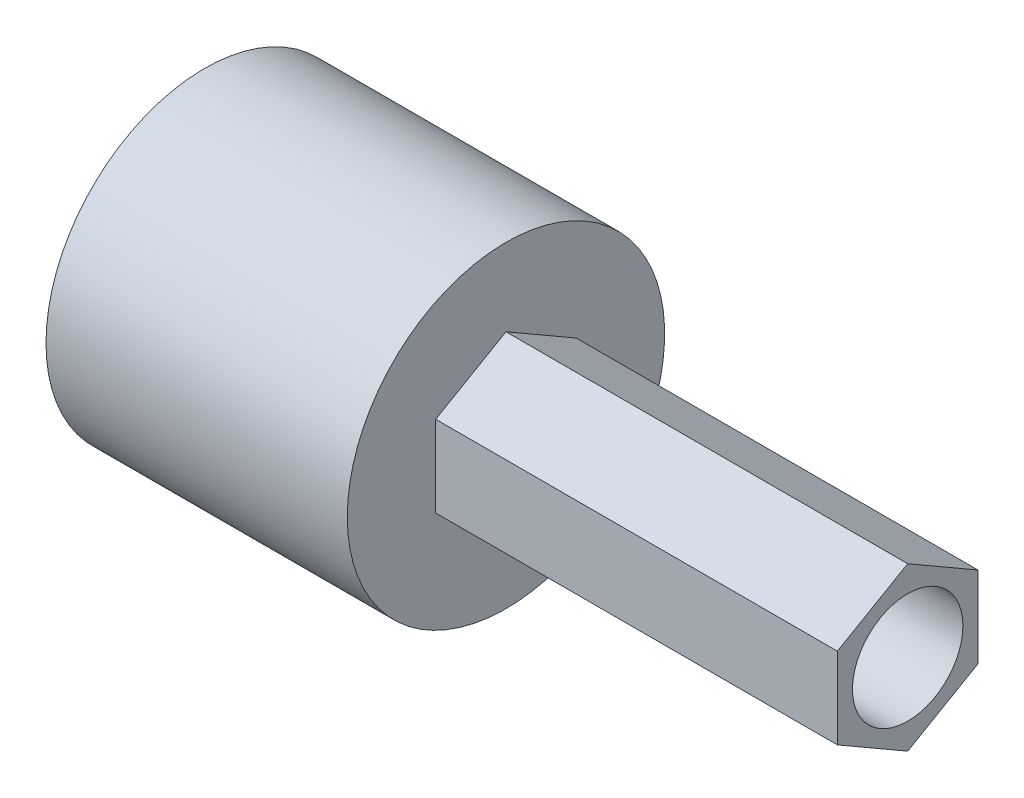
ISO-10303-21;
HEADER;
FILE_DESCRIPTION(('STEP AP214'),'2;1');
FILE_NAME('part.step','',(''),(''),'','','');
FILE_SCHEMA(('AUTOMOTIVE_DESIGN { 1 0 10303 214 1 1 1 1 }'));
ENDSEC;
DATA;
#1=APPLICATION_CONTEXT('core data for automotive mechanical design processes');
#2=APPLICATION_PROTOCOL_DEFINITION('international standard','automotive_design',2000,#1);
#3=PRODUCT_CONTEXT('',#1,'mechanical');
#4=PRODUCT('Part','Part','',(#3));
#5=PRODUCT_RELATED_PRODUCT_CATEGORY('part','',(#4));
#6=PRODUCT_DEFINITION_FORMATION('','',#4);
#7=PRODUCT_DEFINITION_CONTEXT('part definition',#1,'design');
#8=PRODUCT_DEFINITION('design','',#6,#7);
#9=PRODUCT_DEFINITION_SHAPE('','',#8);
#10=(LENGTH_UNIT() NAMED_UNIT(*) SI_UNIT(.MILLI.,.METRE.));
#11=(NAMED_UNIT(*) PLANE_ANGLE_UNIT() SI_UNIT($,.RADIAN.));
#12=(NAMED_UNIT(*) SI_UNIT($,.STERADIAN.) SOLID_ANGLE_UNIT());
#13=UNCERTAINTY_MEASURE_WITH_UNIT(LENGTH_MEASURE(1.E-05),#10,'distance_accuracy_value','');
#14=(GEOMETRIC_REPRESENTATION_CONTEXT(3) GLOBAL_UNCERTAINTY_ASSIGNED_CONTEXT((#13)) GLOBAL_UNIT_ASSIGNED_CONTEXT((#10,
#11,#12)) REPRESENTATION_CONTEXT('',''));
#15=CARTESIAN_POINT('',(0.,0.,0.));
#16=DIRECTION('',(0.,0.,1.));
#17=DIRECTION('',(1.,0.,0.));
#18=AXIS2_PLACEMENT_3D('',#15,#16,#17);
#19=CARTESIAN_POINT('',(-15.,0.,0.));
#20=DIRECTION('',(1.,0.,0.));
#21=DIRECTION('',(0.,0.,-1.));
#22=AXIS2_PLACEMENT_3D('',#19,#20,#21);
#23=CYLINDRICAL_SURFACE('',#22,2.75);
#24=CARTESIAN_POINT('',(20.,0.,0.));
#25=DIRECTION('',(1.,0.,0.));
#26=DIRECTION('',(0.,0.,-1.));
#27=AXIS2_PLACEMENT_3D('',#24,#25,#26);
#28=CIRCLE('',#27,2.75);
#29=CARTESIAN_POINT('',(20.,0.,-2.75));
#30=VERTEX_POINT('',#29);
#31=EDGE_CURVE('E177',#30,#30,#28,.T.);
#32=ORIENTED_EDGE('',*,*,#31,.T.);
#33=EDGE_LOOP('',(#32));
#34=FACE_BOUND('',#33,.T.);
#35=CARTESIAN_POINT('',(-2.7,0.,0.));
#36=DIRECTION('',(-1.,0.,0.));
#37=DIRECTION('',(0.,0.,1.));
#38=AXIS2_PLACEMENT_3D('',#35,#36,#37);
#39=CIRCLE('',#38,2.75);
#40=CARTESIAN_POINT('',(-2.7,0.,2.75));
#41=VERTEX_POINT('',#40);
#42=EDGE_CURVE('E11',#41,#41,#39,.F.);
#43=ORIENTED_EDGE('',*,*,#42,.F.);
#44=EDGE_LOOP('',(#43));
#45=FACE_BOUND('',#44,.T.);
#46=ADVANCED_FACE('F35',(#34,#45),#23,.F.);
#47=CARTESIAN_POINT('',(20.,2.02072594216369,3.5));
#48=DIRECTION('',(0.,0.,-1.));
#49=DIRECTION('',(0.,1.,0.));
#50=AXIS2_PLACEMENT_3D('',#47,#48,#49);
#51=PLANE('',#50);
#52=DIRECTION('',(0.,-1.,0.));
#53=VECTOR('',#52,1.);
#54=CARTESIAN_POINT('',(0.,2.02072594216369,3.5));
#55=LINE('',#54,#53);
#56=CARTESIAN_POINT('',(0.,2.02072594216369,3.5));
#57=VERTEX_POINT('',#56);
#58=CARTESIAN_POINT('',(0.,-2.02072594216369,3.5));
#59=VERTEX_POINT('',#58);
#60=EDGE_CURVE('E89',#57,#59,#55,.T.);
#61=ORIENTED_EDGE('',*,*,#60,.T.);
#62=DIRECTION('',(-1.,0.,0.));
#63=VECTOR('',#62,1.);
#64=CARTESIAN_POINT('',(20.,-2.02072594216369,3.5));
#65=LINE('',#64,#63);
#66=CARTESIAN_POINT('',(20.,-2.02072594216369,3.5));
#67=VERTEX_POINT('',#66);
#68=EDGE_CURVE('E98',#67,#59,#65,.T.);
#69=ORIENTED_EDGE('',*,*,#68,.F.);
#70=DIRECTION('',(0.,-1.,0.));
#71=VECTOR('',#70,1.);
#72=CARTESIAN_POINT('',(20.,2.02072594216369,3.5));
#73=LINE('',#72,#71);
#74=CARTESIAN_POINT('',(20.,2.02072594216369,3.5));
#75=VERTEX_POINT('',#74);
#76=EDGE_CURVE('E124',#75,#67,#73,.T.);
#77=ORIENTED_EDGE('',*,*,#76,.F.);
#78=DIRECTION('',(-1.,0.,0.));
#79=VECTOR('',#78,1.);
#80=CARTESIAN_POINT('',(20.,2.02072594216369,3.5));
#81=LINE('',#80,#79);
#82=EDGE_CURVE('E106',#75,#57,#81,.T.);
#83=ORIENTED_EDGE('',*,*,#82,.T.);
#84=EDGE_LOOP('',(#61,#69,#77,#83));
#85=FACE_BOUND('',#84,.T.);
#86=ADVANCED_FACE('F37',(#85),#51,.F.);
#87=CARTESIAN_POINT('',(20.,-2.02072594216369,3.5));
#88=DIRECTION('',(0.,0.866025403784439,-0.5));
#89=DIRECTION('',(0.,0.5,0.866025403784439));
#90=AXIS2_PLACEMENT_3D('',#87,#88,#89);
#91=PLANE('',#90);
#92=DIRECTION('',(0.,-0.5,-0.866025403784439));
#93=VECTOR('',#92,1.);
#94=CARTESIAN_POINT('',(0.,-2.02072594216369,3.5));
#95=LINE('',#94,#93);
#96=CARTESIAN_POINT('',(0.,-4.04145188432738,0.));
#97=VERTEX_POINT('',#96);
#98=EDGE_CURVE('E84',#59,#97,#95,.T.);
#99=ORIENTED_EDGE('',*,*,#98,.T.);
#100=DIRECTION('',(-1.,0.,0.));
#101=VECTOR('',#100,1.);
#102=CARTESIAN_POINT('',(20.,-4.04145188432738,0.));
#103=LINE('',#102,#101);
#104=CARTESIAN_POINT('',(20.,-4.04145188432738,0.));
#105=VERTEX_POINT('',#104);
#106=EDGE_CURVE('E103',#105,#97,#103,.T.);
#107=ORIENTED_EDGE('',*,*,#106,.F.);
#108=DIRECTION('',(0.,-0.5,-0.866025403784439));
#109=VECTOR('',#108,1.);
#110=CARTESIAN_POINT('',(20.,-2.02072594216369,3.5));
#111=LINE('',#110,#109);
#112=EDGE_CURVE('E100',#67,#105,#111,.T.);
#113=ORIENTED_EDGE('',*,*,#112,.F.);
#114=ORIENTED_EDGE('',*,*,#68,.T.);
#115=EDGE_LOOP('',(#99,#107,#113,#114));
#116=FACE_BOUND('',#115,.T.);
#117=ADVANCED_FACE('F99',(#116),#91,.F.);
#118=CARTESIAN_POINT('',(20.,-4.04145188432738,0.));
#119=DIRECTION('',(0.,0.866025403784439,0.5));
#120=DIRECTION('',(0.,-0.5,0.866025403784439));
#121=AXIS2_PLACEMENT_3D('',#118,#119,#120);
#122=PLANE('',#121);
#123=DIRECTION('',(0.,0.5,-0.866025403784439));
#124=VECTOR('',#123,1.);
#125=CARTESIAN_POINT('',(0.,-4.04145188432738,0.));
#126=LINE('',#125,#124);
#127=CARTESIAN_POINT('',(0.,-2.02072594216369,-3.5));
#128=VERTEX_POINT('',#127);
#129=EDGE_CURVE('E92',#97,#128,#126,.T.);
#130=ORIENTED_EDGE('',*,*,#129,.T.);
#131=DIRECTION('',(-1.,0.,0.));
#132=VECTOR('',#131,1.);
#133=CARTESIAN_POINT('',(20.,-2.02072594216369,-3.5));
#134=LINE('',#133,#132);
#135=CARTESIAN_POINT('',(20.,-2.02072594216369,-3.5));
#136=VERTEX_POINT('',#135);
#137=EDGE_CURVE('E132',#136,#128,#134,.T.);
#138=ORIENTED_EDGE('',*,*,#137,.F.);
#139=DIRECTION('',(0.,0.5,-0.866025403784439));
#140=VECTOR('',#139,1.);
#141=CARTESIAN_POINT('',(20.,-4.04145188432738,0.));
#142=LINE('',#141,#140);
#143=EDGE_CURVE('E184',#105,#136,#142,.T.);
#144=ORIENTED_EDGE('',*,*,#143,.F.);
#145=ORIENTED_EDGE('',*,*,#106,.T.);
#146=EDGE_LOOP('',(#130,#138,#144,#145));
#147=FACE_BOUND('',#146,.T.);
#148=ADVANCED_FACE('F200',(#147),#122,.F.);
#149=CARTESIAN_POINT('',(20.,-2.02072594216369,-3.5));
#150=DIRECTION('',(0.,0.,1.));
#151=DIRECTION('',(0.,-1.,0.));
#152=AXIS2_PLACEMENT_3D('',#149,#150,#151);
#153=PLANE('',#152);
#154=DIRECTION('',(0.,1.,0.));
#155=VECTOR('',#154,1.);
#156=CARTESIAN_POINT('',(0.,-2.02072594216369,-3.5));
#157=LINE('',#156,#155);
#158=CARTESIAN_POINT('',(0.,2.02072594216369,-3.5));
#159=VERTEX_POINT('',#158);
#160=EDGE_CURVE('E116',#128,#159,#157,.T.);
#161=ORIENTED_EDGE('',*,*,#160,.T.);
#162=DIRECTION('',(-1.,0.,0.));
#163=VECTOR('',#162,1.);
#164=CARTESIAN_POINT('',(20.,2.02072594216369,-3.5));
#165=LINE('',#164,#163);
#166=CARTESIAN_POINT('',(20.,2.02072594216369,-3.5));
#167=VERTEX_POINT('',#166);
#168=EDGE_CURVE('E129',#167,#159,#165,.T.);
#169=ORIENTED_EDGE('',*,*,#168,.F.);
#170=DIRECTION('',(0.,1.,0.));
#171=VECTOR('',#170,1.);
#172=CARTESIAN_POINT('',(20.,-2.02072594216369,-3.5));
#173=LINE('',#172,#171);
#174=EDGE_CURVE('E186',#136,#167,#173,.T.);
#175=ORIENTED_EDGE('',*,*,#174,.F.);
#176=ORIENTED_EDGE('',*,*,#137,.T.);
#177=EDGE_LOOP('',(#161,#169,#175,#176));
#178=FACE_BOUND('',#177,.T.);
#179=ADVANCED_FACE('F202',(#178),#153,.F.);
#180=CARTESIAN_POINT('',(20.,2.02072594216369,-3.5));
#181=DIRECTION('',(0.,-0.866025403784439,0.5));
#182=DIRECTION('',(0.,-0.5,-0.866025403784439));
#183=AXIS2_PLACEMENT_3D('',#180,#181,#182);
#184=PLANE('',#183);
#185=DIRECTION('',(0.,0.5,0.866025403784439));
#186=VECTOR('',#185,1.);
#187=CARTESIAN_POINT('',(0.,2.02072594216369,-3.5));
#188=LINE('',#187,#186);
#189=CARTESIAN_POINT('',(0.,4.04145188432738,0.));
#190=VERTEX_POINT('',#189);
#191=EDGE_CURVE('E119',#159,#190,#188,.T.);
#192=ORIENTED_EDGE('',*,*,#191,.T.);
#193=DIRECTION('',(-1.,0.,0.));
#194=VECTOR('',#193,1.);
#195=CARTESIAN_POINT('',(20.,4.04145188432738,0.));
#196=LINE('',#195,#194);
#197=CARTESIAN_POINT('',(20.,4.04145188432738,0.));
#198=VERTEX_POINT('',#197);
#199=EDGE_CURVE('E126',#198,#190,#196,.T.);
#200=ORIENTED_EDGE('',*,*,#199,.F.);
#201=DIRECTION('',(0.,0.5,0.866025403784439));
#202=VECTOR('',#201,1.);
#203=CARTESIAN_POINT('',(20.,2.02072594216369,-3.5));
#204=LINE('',#203,#202);
#205=EDGE_CURVE('E187',#167,#198,#204,.T.);
#206=ORIENTED_EDGE('',*,*,#205,.F.);
#207=ORIENTED_EDGE('',*,*,#168,.T.);
#208=EDGE_LOOP('',(#192,#200,#206,#207));
#209=FACE_BOUND('',#208,.T.);
#210=ADVANCED_FACE('F194',(#209),#184,.F.);
#211=CARTESIAN_POINT('',(20.,4.04145188432738,0.));
#212=DIRECTION('',(0.,-0.866025403784439,-0.5));
#213=DIRECTION('',(0.,0.5,-0.866025403784439));
#214=AXIS2_PLACEMENT_3D('',#211,#212,#213);
#215=PLANE('',#214);
#216=DIRECTION('',(0.,-0.5,0.866025403784439));
#217=VECTOR('',#216,1.);
#218=CARTESIAN_POINT('',(0.,4.04145188432738,0.));
#219=LINE('',#218,#217);
#220=EDGE_CURVE('E122',#190,#57,#219,.T.);
#221=ORIENTED_EDGE('',*,*,#220,.T.);
#222=ORIENTED_EDGE('',*,*,#82,.F.);
#223=DIRECTION('',(0.,-0.5,0.866025403784439));
#224=VECTOR('',#223,1.);
#225=CARTESIAN_POINT('',(20.,4.04145188432738,0.));
#226=LINE('',#225,#224);
#227=EDGE_CURVE('E51',#198,#75,#226,.T.);
#228=ORIENTED_EDGE('',*,*,#227,.F.);
#229=ORIENTED_EDGE('',*,*,#199,.T.);
#230=EDGE_LOOP('',(#221,#222,#228,#229));
#231=FACE_BOUND('',#230,.T.);
#232=ADVANCED_FACE('F196',(#231),#215,.F.);
#233=CARTESIAN_POINT('',(20.,0.,0.));
#234=DIRECTION('',(1.,0.,0.));
#235=DIRECTION('',(0.,0.,-1.));
#236=AXIS2_PLACEMENT_3D('',#233,#234,#235);
#237=PLANE('',#236);
#238=ORIENTED_EDGE('',*,*,#31,.F.);
#239=EDGE_LOOP('',(#238));
#240=FACE_BOUND('',#239,.T.);
#241=ORIENTED_EDGE('',*,*,#76,.T.);
#242=ORIENTED_EDGE('',*,*,#112,.T.);
#243=ORIENTED_EDGE('',*,*,#143,.T.);
#244=ORIENTED_EDGE('',*,*,#174,.T.);
#245=ORIENTED_EDGE('',*,*,#205,.T.);
#246=ORIENTED_EDGE('',*,*,#227,.T.);
#247=EDGE_LOOP('',(#241,#242,#243,#244,#245,#246));
#248=FACE_BOUND('',#247,.T.);
#249=ADVANCED_FACE('F190',(#240,#248),#237,.T.);
#250=CARTESIAN_POINT('',(-3.,0.,0.));
#251=DIRECTION('',(1.,0.,0.));
#252=DIRECTION('',(0.,0.,-1.));
#253=AXIS2_PLACEMENT_3D('',#250,#251,#252);
#254=CYLINDRICAL_SURFACE('',#253,7.9);
#255=CARTESIAN_POINT('',(0.,0.,0.));
#256=DIRECTION('',(-1.,0.,0.));
#257=DIRECTION('',(0.,0.,1.));
#258=AXIS2_PLACEMENT_3D('',#255,#256,#257);
#259=CIRCLE('',#258,7.9);
#260=CARTESIAN_POINT('',(0.,0.,7.9));
#261=VERTEX_POINT('',#260);
#262=EDGE_CURVE('E107',#261,#261,#259,.T.);
#263=ORIENTED_EDGE('',*,*,#262,.T.);
#264=EDGE_LOOP('',(#263));
#265=FACE_BOUND('',#264,.T.);
#266=CARTESIAN_POINT('',(-15.,0.,0.));
#267=DIRECTION('',(-1.,0.,0.));
#268=DIRECTION('',(0.,0.,1.));
#269=AXIS2_PLACEMENT_3D('',#266,#267,#268);
#270=CIRCLE('',#269,7.9);
#271=CARTESIAN_POINT('',(-15.,0.,7.9));
#272=VERTEX_POINT('',#271);
#273=EDGE_CURVE('E110',#272,#272,#270,.T.);
#274=ORIENTED_EDGE('',*,*,#273,.F.);
#275=EDGE_LOOP('',(#274));
#276=FACE_BOUND('',#275,.T.);
#277=ADVANCED_FACE('F170',(#265,#276),#254,.T.);
#278=CARTESIAN_POINT('',(0.,0.,0.));
#279=DIRECTION('',(-1.,0.,0.));
#280=DIRECTION('',(0.,0.,1.));
#281=AXIS2_PLACEMENT_3D('',#278,#279,#280);
#282=PLANE('',#281);
#283=ORIENTED_EDGE('',*,*,#60,.F.);
#284=ORIENTED_EDGE('',*,*,#220,.F.);
#285=ORIENTED_EDGE('',*,*,#191,.F.);
#286=ORIENTED_EDGE('',*,*,#160,.F.);
#287=ORIENTED_EDGE('',*,*,#129,.F.);
#288=ORIENTED_EDGE('',*,*,#98,.F.);
#289=EDGE_LOOP('',(#283,#284,#285,#286,#287,#288));
#290=FACE_BOUND('',#289,.T.);
#291=ORIENTED_EDGE('',*,*,#262,.F.);
#292=EDGE_LOOP('',(#291));
#293=FACE_BOUND('',#292,.T.);
#294=ADVANCED_FACE('F86',(#290,#293),#282,.F.);
#295=CARTESIAN_POINT('',(-15.,0.,0.));
#296=DIRECTION('',(-1.,0.,0.));
#297=DIRECTION('',(0.,0.,1.));
#298=AXIS2_PLACEMENT_3D('',#295,#296,#297);
#299=PLANE('',#298);
#300=ORIENTED_EDGE('',*,*,#273,.T.);
#301=EDGE_LOOP('',(#300));
#302=FACE_BOUND('',#301,.T.);
#303=CARTESIAN_POINT('',(-15.,0.,0.));
#304=DIRECTION('',(-1.,0.,0.));
#305=DIRECTION('',(0.,0.,1.));
#306=AXIS2_PLACEMENT_3D('',#303,#304,#305);
#307=CIRCLE('',#306,4.9);
#308=CARTESIAN_POINT('',(-15.,0.,4.9));
#309=VERTEX_POINT('',#308);
#310=EDGE_CURVE('E176',#309,#309,#307,.T.);
#311=ORIENTED_EDGE('',*,*,#310,.F.);
#312=EDGE_LOOP('',(#311));
#313=FACE_BOUND('',#312,.T.);
#314=ADVANCED_FACE('F151',(#302,#313),#299,.T.);
#315=CARTESIAN_POINT('',(-15.,0.,0.));
#316=DIRECTION('',(1.,0.,0.));
#317=DIRECTION('',(0.,0.,-1.));
#318=AXIS2_PLACEMENT_3D('',#315,#316,#317);
#319=CYLINDRICAL_SURFACE('',#318,4.9);
#320=ORIENTED_EDGE('',*,*,#310,.T.);
#321=EDGE_LOOP('',(#320));
#322=FACE_BOUND('',#321,.T.);
#323=CARTESIAN_POINT('',(-3.,0.,0.));
#324=DIRECTION('',(-1.,0.,0.));
#325=DIRECTION('',(0.,0.,1.));
#326=AXIS2_PLACEMENT_3D('',#323,#324,#325);
#327=CIRCLE('',#326,4.9);
#328=CARTESIAN_POINT('',(-3.,0.,4.9));
#329=VERTEX_POINT('',#328);
#330=EDGE_CURVE('E44',#329,#329,#327,.F.);
#331=ORIENTED_EDGE('',*,*,#330,.T.);
#332=EDGE_LOOP('',(#331));
#333=FACE_BOUND('',#332,.T.);
#334=ADVANCED_FACE('F138',(#322,#333),#319,.F.);
#335=CARTESIAN_POINT('',(-3.,0.,0.));
#336=DIRECTION('',(-1.,0.,0.));
#337=DIRECTION('',(0.,0.,1.));
#338=AXIS2_PLACEMENT_3D('',#335,#336,#337);
#339=PLANE('',#338);
#340=ORIENTED_EDGE('',*,*,#330,.F.);
#341=EDGE_LOOP('',(#340));
#342=FACE_BOUND('',#341,.T.);
#343=ADVANCED_FACE('F140',(#342),#339,.T.);
#344=CARTESIAN_POINT('',(-2.7,0.,0.));
#345=DIRECTION('',(-1.,0.,0.));
#346=DIRECTION('',(0.,0.,1.));
#347=AXIS2_PLACEMENT_3D('',#344,#345,#346);
#348=PLANE('',#347);
#349=ORIENTED_EDGE('',*,*,#42,.T.);
#350=EDGE_LOOP('',(#349));
#351=FACE_BOUND('',#350,.T.);
#352=ADVANCED_FACE('F142',(#351),#348,.F.);
#353=CLOSED_SHELL('',(#46,#86,#117,#148,#179,#210,#232,#249,#277,#294,#314,#334,#343,#352));
#354=MANIFOLD_SOLID_BREP('B2',#353);
#355=ADVANCED_BREP_SHAPE_REPRESENTATION('',(#18,#354),#14);
#356=SHAPE_DEFINITION_REPRESENTATION(#9,#355);
ENDSEC;
END-ISO-10303-21;
